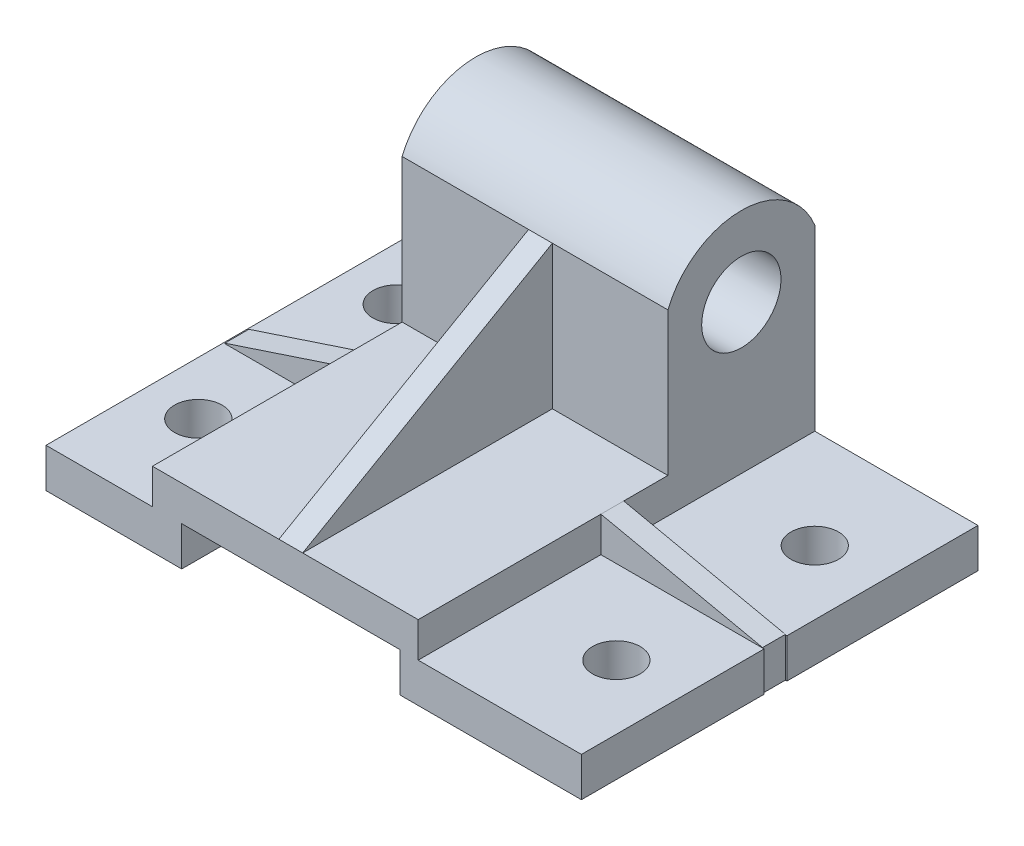
ISO-10303-21;
HEADER;
FILE_DESCRIPTION(('STEP AP214'),'2;1');
FILE_NAME('part.step','',(''),(''),'','','');
FILE_SCHEMA(('AUTOMOTIVE_DESIGN { 1 0 10303 214 1 1 1 1 }'));
ENDSEC;
DATA;
#1=APPLICATION_CONTEXT('core data for automotive mechanical design processes');
#2=APPLICATION_PROTOCOL_DEFINITION('international standard','automotive_design',2000,#1);
#3=PRODUCT_CONTEXT('',#1,'mechanical');
#4=PRODUCT('Part','Part','',(#3));
#5=PRODUCT_RELATED_PRODUCT_CATEGORY('part','',(#4));
#6=PRODUCT_DEFINITION_FORMATION('','',#4);
#7=PRODUCT_DEFINITION_CONTEXT('part definition',#1,'design');
#8=PRODUCT_DEFINITION('design','',#6,#7);
#9=PRODUCT_DEFINITION_SHAPE('','',#8);
#10=(LENGTH_UNIT() NAMED_UNIT(*) SI_UNIT(.MILLI.,.METRE.));
#11=(NAMED_UNIT(*) PLANE_ANGLE_UNIT() SI_UNIT($,.RADIAN.));
#12=(NAMED_UNIT(*) SI_UNIT($,.STERADIAN.) SOLID_ANGLE_UNIT());
#13=UNCERTAINTY_MEASURE_WITH_UNIT(LENGTH_MEASURE(1.E-05),#10,'distance_accuracy_value','');
#14=(GEOMETRIC_REPRESENTATION_CONTEXT(3) GLOBAL_UNCERTAINTY_ASSIGNED_CONTEXT((#13)) GLOBAL_UNIT_ASSIGNED_CONTEXT((#10,
#11,#12)) REPRESENTATION_CONTEXT('',''));
#15=CARTESIAN_POINT('',(0.,0.,0.));
#16=DIRECTION('',(0.,0.,1.));
#17=DIRECTION('',(1.,0.,0.));
#18=AXIS2_PLACEMENT_3D('',#15,#16,#17);
#19=CARTESIAN_POINT('',(73.2762836185819,9.90220048899755,-100.));
#20=DIRECTION('',(1.,0.,0.));
#21=DIRECTION('',(0.,0.,-1.));
#22=AXIS2_PLACEMENT_3D('',#19,#20,#21);
#23=PLANE('',#22);
#24=DIRECTION('',(0.,1.,0.));
#25=VECTOR('',#24,1.);
#26=CARTESIAN_POINT('',(73.2762836185819,9.90220048899751,-51.82695280741));
#27=LINE('',#26,#25);
#28=CARTESIAN_POINT('',(73.2762836185819,0.,-51.82695280741));
#29=VERTEX_POINT('',#28);
#30=CARTESIAN_POINT('',(73.2762836185819,9.90220048899755,-51.82695280741));
#31=VERTEX_POINT('',#30);
#32=EDGE_CURVE('E526',#29,#31,#27,.T.);
#33=ORIENTED_EDGE('',*,*,#32,.F.);
#34=DIRECTION('',(0.,0.,1.));
#35=VECTOR('',#34,1.);
#36=CARTESIAN_POINT('',(73.2762836185819,0.,-100.));
#37=LINE('',#36,#35);
#38=CARTESIAN_POINT('',(73.2762836185819,0.,-100.));
#39=VERTEX_POINT('',#38);
#40=EDGE_CURVE('E438',#39,#29,#37,.T.);
#41=ORIENTED_EDGE('',*,*,#40,.F.);
#42=DIRECTION('',(0.,1.,0.));
#43=VECTOR('',#42,1.);
#44=CARTESIAN_POINT('',(73.2762836185819,9.90220048899755,-100.));
#45=LINE('',#44,#43);
#46=CARTESIAN_POINT('',(73.2762836185819,9.90220048899755,-100.));
#47=VERTEX_POINT('',#46);
#48=EDGE_CURVE('E381',#39,#47,#45,.T.);
#49=ORIENTED_EDGE('',*,*,#48,.T.);
#50=DIRECTION('',(0.,0.,1.));
#51=VECTOR('',#50,1.);
#52=CARTESIAN_POINT('',(73.2762836185819,9.90220048899755,-100.));
#53=LINE('',#52,#51);
#54=EDGE_CURVE('E434',#47,#31,#53,.T.);
#55=ORIENTED_EDGE('',*,*,#54,.T.);
#56=EDGE_LOOP('',(#33,#41,#49,#55));
#57=FACE_BOUND('',#56,.T.);
#58=ADVANCED_FACE('F33',(#57),#23,.T.);
#59=CARTESIAN_POINT('',(31.6683148457741,9.90220048899755,-100.));
#60=DIRECTION('',(0.,1.,0.));
#61=DIRECTION('',(0.,0.,1.));
#62=AXIS2_PLACEMENT_3D('',#59,#60,#61);
#63=PLANE('',#62);
#64=CARTESIAN_POINT('',(57.109031968355,9.90220048899755,-24.9834886291718));
#65=DIRECTION('',(0.,1.,0.));
#66=DIRECTION('',(0.,0.,1.));
#67=AXIS2_PLACEMENT_3D('',#64,#65,#66);
#68=CIRCLE('',#67,6.);
#69=CARTESIAN_POINT('',(57.109031968355,9.90220048899755,-18.9834886291718));
#70=VERTEX_POINT('',#69);
#71=EDGE_CURVE('E304',#70,#70,#68,.T.);
#72=ORIENTED_EDGE('',*,*,#71,.F.);
#73=EDGE_LOOP('',(#72));
#74=FACE_BOUND('',#73,.T.);
#75=CARTESIAN_POINT('',(73.2762836185819,9.90220048899755,-46.0681130754779));
#76=VERTEX_POINT('',#75);
#77=CARTESIAN_POINT('',(73.2762836185819,9.90220048899755,0.));
#78=VERTEX_POINT('',#77);
#79=EDGE_CURVE('E437',#76,#78,#53,.T.);
#80=ORIENTED_EDGE('',*,*,#79,.F.);
#81=DIRECTION('',(-1.,0.,0.));
#82=VECTOR('',#81,1.);
#83=CARTESIAN_POINT('',(74.1194687660905,9.90220048899755,-46.0681130754779));
#84=LINE('',#83,#82);
#85=CARTESIAN_POINT('',(72.8841531670512,9.90220048899754,-46.0681130754779));
#86=VERTEX_POINT('',#85);
#87=EDGE_CURVE('E258',#76,#86,#84,.T.);
#88=ORIENTED_EDGE('',*,*,#87,.T.);
#89=CARTESIAN_POINT('',(32.1194687660905,9.90220048899755,-46.0681130754779));
#90=VERTEX_POINT('',#89);
#91=EDGE_CURVE('E239',#86,#90,#84,.T.);
#92=ORIENTED_EDGE('',*,*,#91,.T.);
#93=DIRECTION('',(0.,0.,1.));
#94=VECTOR('',#93,1.);
#95=CARTESIAN_POINT('',(32.1194687660905,9.90220048899755,0.));
#96=LINE('',#95,#94);
#97=CARTESIAN_POINT('',(32.1194687660905,9.90220048899755,0.));
#98=VERTEX_POINT('',#97);
#99=EDGE_CURVE('E330',#90,#98,#96,.T.);
#100=ORIENTED_EDGE('',*,*,#99,.T.);
#101=DIRECTION('',(-1.,0.,0.));
#102=VECTOR('',#101,1.);
#103=CARTESIAN_POINT('',(31.6683148457741,9.90220048899755,0.));
#104=LINE('',#103,#102);
#105=EDGE_CURVE('E414',#78,#98,#104,.T.);
#106=ORIENTED_EDGE('',*,*,#105,.F.);
#107=EDGE_LOOP('',(#80,#88,#92,#100,#106));
#108=FACE_BOUND('',#107,.T.);
#109=ADVANCED_FACE('F486',(#74,#108),#63,.T.);
#110=CARTESIAN_POINT('',(57.109031968355,9.90220048899755,-75.0046438024947));
#111=DIRECTION('',(0.,1.,0.));
#112=DIRECTION('',(0.,0.,1.));
#113=AXIS2_PLACEMENT_3D('',#110,#111,#112);
#114=CIRCLE('',#113,6.);
#115=CARTESIAN_POINT('',(57.109031968355,9.90220048899755,-69.0046438024947));
#116=VERTEX_POINT('',#115);
#117=EDGE_CURVE('E308',#116,#116,#114,.T.);
#118=ORIENTED_EDGE('',*,*,#117,.F.);
#119=EDGE_LOOP('',(#118));
#120=FACE_BOUND('',#119,.T.);
#121=CARTESIAN_POINT('',(32.1194687660905,9.90220048899755,-100.));
#122=VERTEX_POINT('',#121);
#123=CARTESIAN_POINT('',(32.1194687660905,9.90220048899755,-51.82695280741));
#124=VERTEX_POINT('',#123);
#125=EDGE_CURVE('E326',#122,#124,#96,.T.);
#126=ORIENTED_EDGE('',*,*,#125,.T.);
#127=DIRECTION('',(-1.,0.,0.));
#128=VECTOR('',#127,1.);
#129=CARTESIAN_POINT('',(74.1194687660905,9.90220048899755,-51.82695280741));
#130=LINE('',#129,#128);
#131=CARTESIAN_POINT('',(72.8841531670512,9.90220048899754,-51.82695280741));
#132=VERTEX_POINT('',#131);
#133=EDGE_CURVE('E254',#132,#124,#130,.T.);
#134=ORIENTED_EDGE('',*,*,#133,.F.);
#135=EDGE_CURVE('E256',#31,#132,#130,.T.);
#136=ORIENTED_EDGE('',*,*,#135,.F.);
#137=ORIENTED_EDGE('',*,*,#54,.F.);
#138=DIRECTION('',(-1.,0.,0.));
#139=VECTOR('',#138,1.);
#140=CARTESIAN_POINT('',(31.6683148457741,9.90220048899755,-100.));
#141=LINE('',#140,#139);
#142=EDGE_CURVE('E384',#47,#122,#141,.T.);
#143=ORIENTED_EDGE('',*,*,#142,.T.);
#144=EDGE_LOOP('',(#126,#134,#136,#137,#143));
#145=FACE_BOUND('',#144,.T.);
#146=ADVANCED_FACE('F492',(#120,#145),#63,.T.);
#147=CARTESIAN_POINT('',(32.1194687660905,47.3569143511102,-81.4805950650293));
#148=DIRECTION('',(1.,0.,0.));
#149=DIRECTION('',(0.,0.,-1.));
#150=AXIS2_PLACEMENT_3D('',#147,#148,#149);
#151=PLANE('',#150);
#152=ORIENTED_EDGE('',*,*,#99,.F.);
#153=DIRECTION('',(0.,-1.,0.));
#154=VECTOR('',#153,1.);
#155=CARTESIAN_POINT('',(32.1194687660905,9.90220048899755,-46.0681130754779));
#156=LINE('',#155,#154);
#157=CARTESIAN_POINT('',(32.1194687660905,18.7499877018524,-46.0681130754779));
#158=VERTEX_POINT('',#157);
#159=EDGE_CURVE('E246',#158,#90,#156,.T.);
#160=ORIENTED_EDGE('',*,*,#159,.F.);
#161=DIRECTION('',(0.,0.,-1.));
#162=VECTOR('',#161,1.);
#163=CARTESIAN_POINT('',(32.1194687660905,18.7499877018524,-62.9611901300586));
#164=LINE('',#163,#162);
#165=CARTESIAN_POINT('',(32.1194687660905,18.7499877018524,0.));
#166=VERTEX_POINT('',#165);
#167=EDGE_CURVE('E334',#166,#158,#164,.T.);
#168=ORIENTED_EDGE('',*,*,#167,.F.);
#169=DIRECTION('',(0.,1.,0.));
#170=VECTOR('',#169,1.);
#171=CARTESIAN_POINT('',(32.1194687660905,18.7499877018524,0.));
#172=LINE('',#171,#170);
#173=EDGE_CURVE('E329',#98,#166,#172,.T.);
#174=ORIENTED_EDGE('',*,*,#173,.F.);
#175=EDGE_LOOP('',(#152,#160,#168,#174));
#176=FACE_BOUND('',#175,.T.);
#177=ADVANCED_FACE('F557',(#176),#151,.T.);
#178=CARTESIAN_POINT('',(32.1194687660905,47.3569143511102,-81.4805950650293));
#179=DIRECTION('',(-1.,0.,0.));
#180=DIRECTION('',(0.,0.,1.));
#181=AXIS2_PLACEMENT_3D('',#178,#179,#180);
#182=CIRCLE('',#181,9.99999999999999);
#183=CARTESIAN_POINT('',(32.1194687660905,47.3569143511102,-71.4805950650293));
#184=VERTEX_POINT('',#183);
#185=EDGE_CURVE('E318',#184,#184,#182,.T.);
#186=ORIENTED_EDGE('',*,*,#185,.T.);
#187=EDGE_LOOP('',(#186));
#188=FACE_BOUND('',#187,.T.);
#189=CARTESIAN_POINT('',(32.1194687660905,18.7499877018524,-51.82695280741));
#190=VERTEX_POINT('',#189);
#191=CARTESIAN_POINT('',(32.1194687660905,18.7499877018524,-62.9611901300586));
#192=VERTEX_POINT('',#191);
#193=EDGE_CURVE('E333',#190,#192,#164,.T.);
#194=ORIENTED_EDGE('',*,*,#193,.F.);
#195=DIRECTION('',(0.,1.,0.));
#196=VECTOR('',#195,1.);
#197=CARTESIAN_POINT('',(32.1194687660905,18.7499877018524,-51.82695280741));
#198=LINE('',#197,#196);
#199=EDGE_CURVE('E248',#124,#190,#198,.T.);
#200=ORIENTED_EDGE('',*,*,#199,.F.);
#201=ORIENTED_EDGE('',*,*,#125,.F.);
#202=DIRECTION('',(0.,-1.,0.));
#203=VECTOR('',#202,1.);
#204=CARTESIAN_POINT('',(32.1194687660905,9.90220048899755,-100.));
#205=LINE('',#204,#203);
#206=CARTESIAN_POINT('',(32.1194687660905,54.9088439624469,-100.));
#207=VERTEX_POINT('',#206);
#208=EDGE_CURVE('E342',#207,#122,#205,.T.);
#209=ORIENTED_EDGE('',*,*,#208,.F.);
#210=CARTESIAN_POINT('',(32.1194687660905,47.3569143511102,-81.4805950650293));
#211=DIRECTION('',(-1.,0.,0.));
#212=DIRECTION('',(0.,0.,-1.));
#213=AXIS2_PLACEMENT_3D('',#210,#211,#212);
#214=CIRCLE('',#213,20.);
#215=CARTESIAN_POINT('',(32.1194687660905,54.9088439624469,-62.9611901300586));
#216=VERTEX_POINT('',#215);
#217=EDGE_CURVE('E339',#216,#207,#214,.T.);
#218=ORIENTED_EDGE('',*,*,#217,.F.);
#219=DIRECTION('',(0.,1.,0.));
#220=VECTOR('',#219,1.);
#221=CARTESIAN_POINT('',(32.1194687660905,54.9088439624469,-62.9611901300586));
#222=LINE('',#221,#220);
#223=EDGE_CURVE('E336',#192,#216,#222,.T.);
#224=ORIENTED_EDGE('',*,*,#223,.F.);
#225=EDGE_LOOP('',(#194,#200,#201,#209,#218,#224));
#226=FACE_BOUND('',#225,.T.);
#227=ADVANCED_FACE('F543',(#188,#226),#151,.T.);
#228=CARTESIAN_POINT('',(-61.7237163814181,9.90220048899755,-100.));
#229=DIRECTION('',(0.,1.,0.));
#230=DIRECTION('',(0.,0.,1.));
#231=AXIS2_PLACEMENT_3D('',#228,#229,#230);
#232=PLANE('',#231);
#233=CARTESIAN_POINT('',(-48.3021238076638,9.90220048899755,-24.9834886291718));
#234=DIRECTION('',(0.,1.,0.));
#235=DIRECTION('',(0.,0.,1.));
#236=AXIS2_PLACEMENT_3D('',#233,#234,#235);
#237=CIRCLE('',#236,6.);
#238=CARTESIAN_POINT('',(-48.3021238076638,9.90220048899755,-18.9834886291718));
#239=VERTEX_POINT('',#238);
#240=EDGE_CURVE('E312',#239,#239,#237,.T.);
#241=ORIENTED_EDGE('',*,*,#240,.F.);
#242=EDGE_LOOP('',(#241));
#243=FACE_BOUND('',#242,.T.);
#244=CARTESIAN_POINT('',(-48.3021238076638,9.90220048899755,-75.0046438024947));
#245=DIRECTION('',(0.,1.,0.));
#246=DIRECTION('',(0.,0.,1.));
#247=AXIS2_PLACEMENT_3D('',#244,#245,#246);
#248=CIRCLE('',#247,6.);
#249=CARTESIAN_POINT('',(-48.3021238076638,9.90220048899755,-69.0046438024947));
#250=VERTEX_POINT('',#249);
#251=EDGE_CURVE('E311',#250,#250,#248,.T.);
#252=ORIENTED_EDGE('',*,*,#251,.F.);
#253=EDGE_LOOP('',(#252));
#254=FACE_BOUND('',#253,.T.);
#255=DIRECTION('',(0.,0.,1.));
#256=VECTOR('',#255,1.);
#257=CARTESIAN_POINT('',(-61.3805312339095,9.90220048899755,-44.7398529123788));
#258=LINE('',#257,#256);
#259=CARTESIAN_POINT('',(-61.3805312339095,9.90220048899755,-50.8076177196593));
#260=VERTEX_POINT('',#259);
#261=CARTESIAN_POINT('',(-61.3805312339095,9.90220048899755,-44.7398529123788));
#262=VERTEX_POINT('',#261);
#263=EDGE_CURVE('E268',#260,#262,#258,.T.);
#264=ORIENTED_EDGE('',*,*,#263,.F.);
#265=DIRECTION('',(1.,0.,0.));
#266=VECTOR('',#265,1.);
#267=CARTESIAN_POINT('',(-61.3805312339095,9.90220048899755,-50.8076177196593));
#268=LINE('',#267,#266);
#269=CARTESIAN_POINT('',(-34.8805312339096,9.90220048899755,-50.8076177196593));
#270=VERTEX_POINT('',#269);
#271=EDGE_CURVE('E279',#260,#270,#268,.T.);
#272=ORIENTED_EDGE('',*,*,#271,.T.);
#273=DIRECTION('',(0.,0.,1.));
#274=VECTOR('',#273,1.);
#275=CARTESIAN_POINT('',(-34.8805312339096,9.90220048899755,-100.));
#276=LINE('',#275,#274);
#277=CARTESIAN_POINT('',(-34.8805312339096,9.90220048899755,-100.));
#278=VERTEX_POINT('',#277);
#279=EDGE_CURVE('E426',#278,#270,#276,.T.);
#280=ORIENTED_EDGE('',*,*,#279,.F.);
#281=DIRECTION('',(-1.,0.,0.));
#282=VECTOR('',#281,1.);
#283=CARTESIAN_POINT('',(-61.7237163814181,9.90220048899755,-100.));
#284=LINE('',#283,#282);
#285=CARTESIAN_POINT('',(-61.7237163814181,9.90220048899755,-100.));
#286=VERTEX_POINT('',#285);
#287=EDGE_CURVE('E390',#278,#286,#284,.T.);
#288=ORIENTED_EDGE('',*,*,#287,.T.);
#289=DIRECTION('',(0.,0.,1.));
#290=VECTOR('',#289,1.);
#291=CARTESIAN_POINT('',(-61.7237163814181,9.90220048899755,-100.));
#292=LINE('',#291,#290);
#293=CARTESIAN_POINT('',(-61.7237163814181,9.90220048899755,0.));
#294=VERTEX_POINT('',#293);
#295=EDGE_CURVE('E41',#286,#294,#292,.T.);
#296=ORIENTED_EDGE('',*,*,#295,.T.);
#297=DIRECTION('',(-1.,0.,0.));
#298=VECTOR('',#297,1.);
#299=CARTESIAN_POINT('',(-61.7237163814181,9.90220048899755,0.));
#300=LINE('',#299,#298);
#301=CARTESIAN_POINT('',(-34.8805312339096,9.90220048899755,0.));
#302=VERTEX_POINT('',#301);
#303=EDGE_CURVE('E366',#302,#294,#300,.T.);
#304=ORIENTED_EDGE('',*,*,#303,.F.);
#305=CARTESIAN_POINT('',(-34.8805312339096,9.90220048899755,-44.7398529123788));
#306=VERTEX_POINT('',#305);
#307=EDGE_CURVE('E429',#306,#302,#276,.T.);
#308=ORIENTED_EDGE('',*,*,#307,.F.);
#309=DIRECTION('',(1.,0.,0.));
#310=VECTOR('',#309,1.);
#311=CARTESIAN_POINT('',(-61.3805312339095,9.90220048899755,-44.7398529123788));
#312=LINE('',#311,#310);
#313=EDGE_CURVE('E274',#262,#306,#312,.T.);
#314=ORIENTED_EDGE('',*,*,#313,.F.);
#315=EDGE_LOOP('',(#264,#272,#280,#288,#296,#304,#308,#314));
#316=FACE_BOUND('',#315,.T.);
#317=ADVANCED_FACE('F564',(#243,#254,#316),#232,.T.);
#318=CARTESIAN_POINT('',(-34.8805312339096,9.90220048899755,-100.));
#319=DIRECTION('',(-1.,0.,0.));
#320=DIRECTION('',(0.,0.,1.));
#321=AXIS2_PLACEMENT_3D('',#318,#319,#320);
#322=PLANE('',#321);
#323=DIRECTION('',(0.,0.,1.));
#324=VECTOR('',#323,1.);
#325=CARTESIAN_POINT('',(-34.8805312339096,18.7499877018524,-100.));
#326=LINE('',#325,#324);
#327=CARTESIAN_POINT('',(-34.8805312339096,18.7499877018524,-62.9611901300586));
#328=VERTEX_POINT('',#327);
#329=CARTESIAN_POINT('',(-34.8805312339096,18.7499877018524,-50.8076177196592));
#330=VERTEX_POINT('',#329);
#331=EDGE_CURVE('E430',#328,#330,#326,.T.);
#332=ORIENTED_EDGE('',*,*,#331,.F.);
#333=DIRECTION('',(0.,1.,0.));
#334=VECTOR('',#333,1.);
#335=CARTESIAN_POINT('',(-34.8805312339096,54.9088439624469,-62.9611901300586));
#336=LINE('',#335,#334);
#337=CARTESIAN_POINT('',(-34.8805312339096,54.9088439624469,-62.9611901300586));
#338=VERTEX_POINT('',#337);
#339=EDGE_CURVE('E321',#328,#338,#336,.T.);
#340=ORIENTED_EDGE('',*,*,#339,.T.);
#341=CARTESIAN_POINT('',(-34.8805312339096,47.3569143511102,-81.4805950650293));
#342=DIRECTION('',(-1.,0.,0.));
#343=DIRECTION('',(0.,0.,-1.));
#344=AXIS2_PLACEMENT_3D('',#341,#342,#343);
#345=CIRCLE('',#344,20.);
#346=CARTESIAN_POINT('',(-34.8805312339096,54.9088439624469,-100.));
#347=VERTEX_POINT('',#346);
#348=EDGE_CURVE('E348',#338,#347,#345,.T.);
#349=ORIENTED_EDGE('',*,*,#348,.T.);
#350=DIRECTION('',(0.,-1.,0.));
#351=VECTOR('',#350,1.);
#352=CARTESIAN_POINT('',(-34.8805312339096,9.90220048899755,-100.));
#353=LINE('',#352,#351);
#354=EDGE_CURVE('E387',#347,#278,#353,.T.);
#355=ORIENTED_EDGE('',*,*,#354,.T.);
#356=ORIENTED_EDGE('',*,*,#279,.T.);
#357=DIRECTION('',(0.,-1.,0.));
#358=VECTOR('',#357,1.);
#359=CARTESIAN_POINT('',(-34.8805312339096,18.7499877018524,-50.8076177196592));
#360=LINE('',#359,#358);
#361=EDGE_CURVE('E265',#330,#270,#360,.T.);
#362=ORIENTED_EDGE('',*,*,#361,.F.);
#363=EDGE_LOOP('',(#332,#340,#349,#355,#356,#362));
#364=FACE_BOUND('',#363,.T.);
#365=CARTESIAN_POINT('',(-34.8805312339096,47.3569143511102,-81.4805950650293));
#366=DIRECTION('',(-1.,0.,0.));
#367=DIRECTION('',(0.,0.,1.));
#368=AXIS2_PLACEMENT_3D('',#365,#366,#367);
#369=CIRCLE('',#368,9.99999999999999);
#370=CARTESIAN_POINT('',(-34.8805312339096,47.3569143511102,-71.4805950650293));
#371=VERTEX_POINT('',#370);
#372=EDGE_CURVE('E322',#371,#371,#369,.T.);
#373=ORIENTED_EDGE('',*,*,#372,.F.);
#374=EDGE_LOOP('',(#373));
#375=FACE_BOUND('',#374,.T.);
#376=ADVANCED_FACE('F588',(#364,#375),#322,.T.);
#377=CARTESIAN_POINT('',(-34.8805312339096,18.7499877018524,-44.7398529123788));
#378=VERTEX_POINT('',#377);
#379=CARTESIAN_POINT('',(-34.8805312339096,18.7499877018524,0.));
#380=VERTEX_POINT('',#379);
#381=EDGE_CURVE('E433',#378,#380,#326,.T.);
#382=ORIENTED_EDGE('',*,*,#381,.F.);
#383=DIRECTION('',(0.,1.,0.));
#384=VECTOR('',#383,1.);
#385=CARTESIAN_POINT('',(-34.8805312339096,18.7499877018524,-44.7398529123788));
#386=LINE('',#385,#384);
#387=EDGE_CURVE('E269',#306,#378,#386,.T.);
#388=ORIENTED_EDGE('',*,*,#387,.F.);
#389=ORIENTED_EDGE('',*,*,#307,.T.);
#390=DIRECTION('',(0.,-1.,0.));
#391=VECTOR('',#390,1.);
#392=CARTESIAN_POINT('',(-34.8805312339096,9.90220048899755,0.));
#393=LINE('',#392,#391);
#394=EDGE_CURVE('E420',#380,#302,#393,.T.);
#395=ORIENTED_EDGE('',*,*,#394,.F.);
#396=EDGE_LOOP('',(#382,#388,#389,#395));
#397=FACE_BOUND('',#396,.T.);
#398=ADVANCED_FACE('F591',(#397),#322,.T.);
#399=CARTESIAN_POINT('',(-34.8805312339096,18.7499877018524,-100.));
#400=DIRECTION('',(0.,1.,0.));
#401=DIRECTION('',(0.,0.,1.));
#402=AXIS2_PLACEMENT_3D('',#399,#400,#401);
#403=PLANE('',#402);
#404=DIRECTION('',(0.,0.,-1.));
#405=VECTOR('',#404,1.);
#406=CARTESIAN_POINT('',(32.1194687660905,18.7499877018524,-9.82695280741001));
#407=LINE('',#406,#405);
#408=EDGE_CURVE('E229',#158,#190,#407,.T.);
#409=ORIENTED_EDGE('',*,*,#408,.T.);
#410=ORIENTED_EDGE('',*,*,#193,.T.);
#411=DIRECTION('',(-1.,0.,0.));
#412=VECTOR('',#411,1.);
#413=CARTESIAN_POINT('',(32.1194687660905,18.7499877018524,-62.9611901300586));
#414=LINE('',#413,#412);
#415=CARTESIAN_POINT('',(3.,18.7499877018524,-62.9611901300586));
#416=VERTEX_POINT('',#415);
#417=EDGE_CURVE('E359',#192,#416,#414,.T.);
#418=ORIENTED_EDGE('',*,*,#417,.T.);
#419=DIRECTION('',(0.,0.,-1.));
#420=VECTOR('',#419,1.);
#421=CARTESIAN_POINT('',(3.,18.7499877018524,0.));
#422=LINE('',#421,#420);
#423=CARTESIAN_POINT('',(3.,18.7499877018524,0.));
#424=VERTEX_POINT('',#423);
#425=EDGE_CURVE('E290',#424,#416,#422,.T.);
#426=ORIENTED_EDGE('',*,*,#425,.F.);
#427=DIRECTION('',(-1.,0.,0.));
#428=VECTOR('',#427,1.);
#429=CARTESIAN_POINT('',(-34.8805312339096,18.7499877018524,0.));
#430=LINE('',#429,#428);
#431=EDGE_CURVE('E417',#166,#424,#430,.T.);
#432=ORIENTED_EDGE('',*,*,#431,.F.);
#433=ORIENTED_EDGE('',*,*,#167,.T.);
#434=EDGE_LOOP('',(#409,#410,#418,#426,#432,#433));
#435=FACE_BOUND('',#434,.T.);
#436=ADVANCED_FACE('F503',(#435),#403,.T.);
#437=CARTESIAN_POINT('',(32.1194687660905,54.9088439624469,-62.9611901300586));
#438=DIRECTION('',(0.,0.,1.));
#439=DIRECTION('',(1.,0.,0.));
#440=AXIS2_PLACEMENT_3D('',#437,#438,#439);
#441=PLANE('',#440);
#442=DIRECTION('',(-1.,0.,0.));
#443=VECTOR('',#442,1.);
#444=CARTESIAN_POINT('',(32.1194687660905,54.9088439624469,-62.9611901300586));
#445=LINE('',#444,#443);
#446=CARTESIAN_POINT('',(3.,54.9088439624469,-62.9611901300586));
#447=VERTEX_POINT('',#446);
#448=EDGE_CURVE('E355',#216,#447,#445,.T.);
#449=ORIENTED_EDGE('',*,*,#448,.T.);
#450=DIRECTION('',(0.,1.,0.));
#451=VECTOR('',#450,1.);
#452=CARTESIAN_POINT('',(3.,18.7499877018524,-62.9611901300586));
#453=LINE('',#452,#451);
#454=EDGE_CURVE('E283',#416,#447,#453,.T.);
#455=ORIENTED_EDGE('',*,*,#454,.F.);
#456=ORIENTED_EDGE('',*,*,#417,.F.);
#457=ORIENTED_EDGE('',*,*,#223,.T.);
#458=EDGE_LOOP('',(#449,#455,#456,#457));
#459=FACE_BOUND('',#458,.T.);
#460=ADVANCED_FACE('F547',(#459),#441,.T.);
#461=CARTESIAN_POINT('',(-61.7237163814181,0.,-100.));
#462=DIRECTION('',(-1.,0.,0.));
#463=DIRECTION('',(0.,0.,1.));
#464=AXIS2_PLACEMENT_3D('',#461,#462,#463);
#465=PLANE('',#464);
#466=DIRECTION('',(0.,-1.,0.));
#467=VECTOR('',#466,1.);
#468=CARTESIAN_POINT('',(-61.7237163814181,0.,0.));
#469=LINE('',#468,#467);
#470=CARTESIAN_POINT('',(-61.7237163814181,0.,0.));
#471=VERTEX_POINT('',#470);
#472=EDGE_CURVE('E354',#294,#471,#469,.T.);
#473=ORIENTED_EDGE('',*,*,#472,.F.);
#474=ORIENTED_EDGE('',*,*,#295,.F.);
#475=DIRECTION('',(0.,-1.,0.));
#476=VECTOR('',#475,1.);
#477=CARTESIAN_POINT('',(-61.7237163814181,0.,-100.));
#478=LINE('',#477,#476);
#479=CARTESIAN_POINT('',(-61.7237163814181,0.,-100.));
#480=VERTEX_POINT('',#479);
#481=EDGE_CURVE('E362',#286,#480,#478,.T.);
#482=ORIENTED_EDGE('',*,*,#481,.T.);
#483=DIRECTION('',(0.,0.,1.));
#484=VECTOR('',#483,1.);
#485=CARTESIAN_POINT('',(-61.7237163814181,0.,-100.));
#486=LINE('',#485,#484);
#487=EDGE_CURVE('E393',#480,#471,#486,.T.);
#488=ORIENTED_EDGE('',*,*,#487,.T.);
#489=EDGE_LOOP('',(#473,#474,#482,#488));
#490=FACE_BOUND('',#489,.T.);
#491=ADVANCED_FACE('F35',(#490),#465,.T.);
#492=DIRECTION('',(0.,0.,1.));
#493=VECTOR('',#492,1.);
#494=CARTESIAN_POINT('',(-34.8805312339096,18.7499877018524,-71.2398529123788));
#495=LINE('',#494,#493);
#496=EDGE_CURVE('E261',#330,#378,#495,.T.);
#497=ORIENTED_EDGE('',*,*,#496,.T.);
#498=ORIENTED_EDGE('',*,*,#381,.T.);
#499=CARTESIAN_POINT('',(-3.,18.7499877018524,0.));
#500=VERTEX_POINT('',#499);
#501=EDGE_CURVE('E55',#500,#380,#430,.T.);
#502=ORIENTED_EDGE('',*,*,#501,.F.);
#503=DIRECTION('',(0.,0.,-1.));
#504=VECTOR('',#503,1.);
#505=CARTESIAN_POINT('',(-3.,18.7499877018524,0.));
#506=LINE('',#505,#504);
#507=CARTESIAN_POINT('',(-3.,18.7499877018524,-62.9611901300586));
#508=VERTEX_POINT('',#507);
#509=EDGE_CURVE('E287',#500,#508,#506,.T.);
#510=ORIENTED_EDGE('',*,*,#509,.T.);
#511=EDGE_CURVE('E345',#508,#328,#414,.T.);
#512=ORIENTED_EDGE('',*,*,#511,.T.);
#513=ORIENTED_EDGE('',*,*,#331,.T.);
#514=EDGE_LOOP('',(#497,#498,#502,#510,#512,#513));
#515=FACE_BOUND('',#514,.T.);
#516=ADVANCED_FACE('F497',(#515),#403,.T.);
#517=DIRECTION('',(0.,-1.,0.));
#518=VECTOR('',#517,1.);
#519=CARTESIAN_POINT('',(73.2762836185819,9.90220048899751,-46.0681130754779));
#520=LINE('',#519,#518);
#521=CARTESIAN_POINT('',(73.2762836185819,0.,-46.0681130754779));
#522=VERTEX_POINT('',#521);
#523=EDGE_CURVE('E506',#76,#522,#520,.T.);
#524=ORIENTED_EDGE('',*,*,#523,.F.);
#525=ORIENTED_EDGE('',*,*,#79,.T.);
#526=DIRECTION('',(0.,1.,0.));
#527=VECTOR('',#526,1.);
#528=CARTESIAN_POINT('',(73.2762836185819,9.90220048899755,0.));
#529=LINE('',#528,#527);
#530=CARTESIAN_POINT('',(73.2762836185819,0.,0.));
#531=VERTEX_POINT('',#530);
#532=EDGE_CURVE('E411',#531,#78,#529,.T.);
#533=ORIENTED_EDGE('',*,*,#532,.F.);
#534=EDGE_CURVE('E441',#522,#531,#37,.T.);
#535=ORIENTED_EDGE('',*,*,#534,.F.);
#536=EDGE_LOOP('',(#524,#525,#533,#535));
#537=FACE_BOUND('',#536,.T.);
#538=ADVANCED_FACE('F465',(#537),#23,.T.);
#539=CARTESIAN_POINT('',(27.5,0.,-100.));
#540=DIRECTION('',(0.,-1.,0.));
#541=DIRECTION('',(1.,0.,0.));
#542=AXIS2_PLACEMENT_3D('',#539,#540,#541);
#543=PLANE('',#542);
#544=DIRECTION('',(1.,0.,0.));
#545=VECTOR('',#544,1.);
#546=CARTESIAN_POINT('',(27.5,0.,-51.82695280741));
#547=LINE('',#546,#545);
#548=CARTESIAN_POINT('',(72.8841531670512,0.,-51.82695280741));
#549=VERTEX_POINT('',#548);
#550=EDGE_CURVE('E528',#549,#29,#547,.T.);
#551=ORIENTED_EDGE('',*,*,#550,.F.);
#552=DIRECTION('',(0.,0.,-1.));
#553=VECTOR('',#552,1.);
#554=CARTESIAN_POINT('',(72.8841531670512,0.,-100.));
#555=LINE('',#554,#553);
#556=CARTESIAN_POINT('',(72.8841531670512,0.,-46.0681130754779));
#557=VERTEX_POINT('',#556);
#558=EDGE_CURVE('E525',#557,#549,#555,.T.);
#559=ORIENTED_EDGE('',*,*,#558,.F.);
#560=DIRECTION('',(-1.,0.,0.));
#561=VECTOR('',#560,1.);
#562=CARTESIAN_POINT('',(27.5000000000006,0.,-46.0681130754774));
#563=LINE('',#562,#561);
#564=EDGE_CURVE('E512',#522,#557,#563,.T.);
#565=ORIENTED_EDGE('',*,*,#564,.F.);
#566=ORIENTED_EDGE('',*,*,#534,.T.);
#567=DIRECTION('',(1.,0.,0.));
#568=VECTOR('',#567,1.);
#569=CARTESIAN_POINT('',(27.5,0.,0.));
#570=LINE('',#569,#568);
#571=CARTESIAN_POINT('',(27.5,0.,0.));
#572=VERTEX_POINT('',#571);
#573=EDGE_CURVE('E408',#572,#531,#570,.T.);
#574=ORIENTED_EDGE('',*,*,#573,.F.);
#575=DIRECTION('',(0.,0.,1.));
#576=VECTOR('',#575,1.);
#577=CARTESIAN_POINT('',(27.5,0.,-100.));
#578=LINE('',#577,#576);
#579=CARTESIAN_POINT('',(27.5,0.,-100.));
#580=VERTEX_POINT('',#579);
#581=EDGE_CURVE('E442',#580,#572,#578,.T.);
#582=ORIENTED_EDGE('',*,*,#581,.F.);
#583=DIRECTION('',(1.,0.,0.));
#584=VECTOR('',#583,1.);
#585=CARTESIAN_POINT('',(27.5,0.,-100.));
#586=LINE('',#585,#584);
#587=EDGE_CURVE('E378',#580,#39,#586,.T.);
#588=ORIENTED_EDGE('',*,*,#587,.T.);
#589=ORIENTED_EDGE('',*,*,#40,.T.);
#590=EDGE_LOOP('',(#551,#559,#565,#566,#574,#582,#588,#589));
#591=FACE_BOUND('',#590,.T.);
#592=CARTESIAN_POINT('',(57.109031968355,0.,-75.0046438024947));
#593=DIRECTION('',(0.,-1.,0.));
#594=DIRECTION('',(1.,0.,0.));
#595=AXIS2_PLACEMENT_3D('',#592,#593,#594);
#596=CIRCLE('',#595,6.);
#597=CARTESIAN_POINT('',(63.109031968355,0.,-75.0046438024947));
#598=VERTEX_POINT('',#597);
#599=EDGE_CURVE('E307',#598,#598,#596,.T.);
#600=ORIENTED_EDGE('',*,*,#599,.F.);
#601=EDGE_LOOP('',(#600));
#602=FACE_BOUND('',#601,.T.);
#603=CARTESIAN_POINT('',(57.109031968355,0.,-24.9834886291718));
#604=DIRECTION('',(0.,-1.,0.));
#605=DIRECTION('',(1.,0.,0.));
#606=AXIS2_PLACEMENT_3D('',#603,#604,#605);
#607=CIRCLE('',#606,6.);
#608=CARTESIAN_POINT('',(63.109031968355,0.,-24.9834886291718));
#609=VERTEX_POINT('',#608);
#610=EDGE_CURVE('E303',#609,#609,#607,.T.);
#611=ORIENTED_EDGE('',*,*,#610,.F.);
#612=EDGE_LOOP('',(#611));
#613=FACE_BOUND('',#612,.T.);
#614=ADVANCED_FACE('F461',(#591,#602,#613),#543,.T.);
#615=CARTESIAN_POINT('',(27.5,9.90220048899755,-100.));
#616=DIRECTION('',(-1.,0.,0.));
#617=DIRECTION('',(0.,0.,1.));
#618=AXIS2_PLACEMENT_3D('',#615,#616,#617);
#619=PLANE('',#618);
#620=DIRECTION('',(0.,-1.,0.));
#621=VECTOR('',#620,1.);
#622=CARTESIAN_POINT('',(27.5,9.90220048899755,0.));
#623=LINE('',#622,#621);
#624=CARTESIAN_POINT('',(27.5,9.90220048899755,0.));
#625=VERTEX_POINT('',#624);
#626=EDGE_CURVE('E405',#625,#572,#623,.T.);
#627=ORIENTED_EDGE('',*,*,#626,.F.);
#628=DIRECTION('',(0.,0.,1.));
#629=VECTOR('',#628,1.);
#630=CARTESIAN_POINT('',(27.5,9.90220048899755,-100.));
#631=LINE('',#630,#629);
#632=CARTESIAN_POINT('',(27.5,9.90220048899755,-100.));
#633=VERTEX_POINT('',#632);
#634=EDGE_CURVE('E444',#633,#625,#631,.T.);
#635=ORIENTED_EDGE('',*,*,#634,.F.);
#636=DIRECTION('',(0.,-1.,0.));
#637=VECTOR('',#636,1.);
#638=CARTESIAN_POINT('',(27.5,9.90220048899755,-100.));
#639=LINE('',#638,#637);
#640=EDGE_CURVE('E375',#633,#580,#639,.T.);
#641=ORIENTED_EDGE('',*,*,#640,.T.);
#642=ORIENTED_EDGE('',*,*,#581,.T.);
#643=EDGE_LOOP('',(#627,#635,#641,#642));
#644=FACE_BOUND('',#643,.T.);
#645=ADVANCED_FACE('F464',(#644),#619,.T.);
#646=CARTESIAN_POINT('',(-27.5,9.90220048899755,-100.));
#647=DIRECTION('',(0.,-1.,0.));
#648=DIRECTION('',(0.,0.,-1.));
#649=AXIS2_PLACEMENT_3D('',#646,#647,#648);
#650=PLANE('',#649);
#651=DIRECTION('',(1.,0.,0.));
#652=VECTOR('',#651,1.);
#653=CARTESIAN_POINT('',(-27.5,9.90220048899755,0.));
#654=LINE('',#653,#652);
#655=CARTESIAN_POINT('',(-27.5,9.90220048899755,0.));
#656=VERTEX_POINT('',#655);
#657=EDGE_CURVE('E402',#656,#625,#654,.T.);
#658=ORIENTED_EDGE('',*,*,#657,.F.);
#659=DIRECTION('',(0.,0.,1.));
#660=VECTOR('',#659,1.);
#661=CARTESIAN_POINT('',(-27.5,9.90220048899755,-100.));
#662=LINE('',#661,#660);
#663=CARTESIAN_POINT('',(-27.5,9.90220048899755,-100.));
#664=VERTEX_POINT('',#663);
#665=EDGE_CURVE('E446',#664,#656,#662,.T.);
#666=ORIENTED_EDGE('',*,*,#665,.F.);
#667=DIRECTION('',(1.,0.,0.));
#668=VECTOR('',#667,1.);
#669=CARTESIAN_POINT('',(-27.5,9.90220048899755,-100.));
#670=LINE('',#669,#668);
#671=EDGE_CURVE('E372',#664,#633,#670,.T.);
#672=ORIENTED_EDGE('',*,*,#671,.T.);
#673=ORIENTED_EDGE('',*,*,#634,.T.);
#674=EDGE_LOOP('',(#658,#666,#672,#673));
#675=FACE_BOUND('',#674,.T.);
#676=ADVANCED_FACE('F834',(#675),#650,.T.);
#677=CARTESIAN_POINT('',(-27.5,0.,-100.));
#678=DIRECTION('',(1.,0.,0.));
#679=DIRECTION('',(0.,0.,-1.));
#680=AXIS2_PLACEMENT_3D('',#677,#678,#679);
#681=PLANE('',#680);
#682=DIRECTION('',(0.,1.,0.));
#683=VECTOR('',#682,1.);
#684=CARTESIAN_POINT('',(-27.5,0.,0.));
#685=LINE('',#684,#683);
#686=CARTESIAN_POINT('',(-27.5,0.,0.));
#687=VERTEX_POINT('',#686);
#688=EDGE_CURVE('E399',#687,#656,#685,.T.);
#689=ORIENTED_EDGE('',*,*,#688,.F.);
#690=DIRECTION('',(0.,0.,1.));
#691=VECTOR('',#690,1.);
#692=CARTESIAN_POINT('',(-27.5,0.,-100.));
#693=LINE('',#692,#691);
#694=CARTESIAN_POINT('',(-27.5,0.,-100.));
#695=VERTEX_POINT('',#694);
#696=EDGE_CURVE('E448',#695,#687,#693,.T.);
#697=ORIENTED_EDGE('',*,*,#696,.F.);
#698=DIRECTION('',(0.,1.,0.));
#699=VECTOR('',#698,1.);
#700=CARTESIAN_POINT('',(-27.5,0.,-100.));
#701=LINE('',#700,#699);
#702=EDGE_CURVE('E369',#695,#664,#701,.T.);
#703=ORIENTED_EDGE('',*,*,#702,.T.);
#704=ORIENTED_EDGE('',*,*,#665,.T.);
#705=EDGE_LOOP('',(#689,#697,#703,#704));
#706=FACE_BOUND('',#705,.T.);
#707=ADVANCED_FACE('F838',(#706),#681,.T.);
#708=CARTESIAN_POINT('',(-61.7237163814181,0.,-100.));
#709=DIRECTION('',(0.,-1.,0.));
#710=DIRECTION('',(0.,0.,-1.));
#711=AXIS2_PLACEMENT_3D('',#708,#709,#710);
#712=PLANE('',#711);
#713=CARTESIAN_POINT('',(-48.3021238076638,0.,-24.9834886291718));
#714=DIRECTION('',(0.,-1.,0.));
#715=DIRECTION('',(0.,0.,-1.));
#716=AXIS2_PLACEMENT_3D('',#713,#714,#715);
#717=CIRCLE('',#716,6.);
#718=CARTESIAN_POINT('',(-48.3021238076638,0.,-30.9834886291718));
#719=VERTEX_POINT('',#718);
#720=EDGE_CURVE('E325',#719,#719,#717,.T.);
#721=ORIENTED_EDGE('',*,*,#720,.F.);
#722=EDGE_LOOP('',(#721));
#723=FACE_BOUND('',#722,.T.);
#724=CARTESIAN_POINT('',(-48.3021238076638,0.,-75.0046438024947));
#725=DIRECTION('',(0.,-1.,0.));
#726=DIRECTION('',(0.,0.,-1.));
#727=AXIS2_PLACEMENT_3D('',#724,#725,#726);
#728=CIRCLE('',#727,6.);
#729=CARTESIAN_POINT('',(-48.3021238076638,0.,-81.0046438024947));
#730=VERTEX_POINT('',#729);
#731=EDGE_CURVE('E315',#730,#730,#728,.T.);
#732=ORIENTED_EDGE('',*,*,#731,.F.);
#733=EDGE_LOOP('',(#732));
#734=FACE_BOUND('',#733,.T.);
#735=DIRECTION('',(1.,0.,0.));
#736=VECTOR('',#735,1.);
#737=CARTESIAN_POINT('',(-61.7237163814181,0.,0.));
#738=LINE('',#737,#736);
#739=EDGE_CURVE('E396',#471,#687,#738,.T.);
#740=ORIENTED_EDGE('',*,*,#739,.F.);
#741=ORIENTED_EDGE('',*,*,#487,.F.);
#742=DIRECTION('',(1.,0.,0.));
#743=VECTOR('',#742,1.);
#744=CARTESIAN_POINT('',(-61.7237163814181,0.,-100.));
#745=LINE('',#744,#743);
#746=EDGE_CURVE('E365',#480,#695,#745,.T.);
#747=ORIENTED_EDGE('',*,*,#746,.T.);
#748=ORIENTED_EDGE('',*,*,#696,.T.);
#749=EDGE_LOOP('',(#740,#741,#747,#748));
#750=FACE_BOUND('',#749,.T.);
#751=ADVANCED_FACE('F582',(#723,#734,#750),#712,.T.);
#752=CARTESIAN_POINT('',(0.,0.,-100.));
#753=DIRECTION('',(0.,0.,-1.));
#754=DIRECTION('',(-1.,0.,0.));
#755=AXIS2_PLACEMENT_3D('',#752,#753,#754);
#756=PLANE('',#755);
#757=ORIENTED_EDGE('',*,*,#354,.F.);
#758=DIRECTION('',(-1.,0.,0.));
#759=VECTOR('',#758,1.);
#760=CARTESIAN_POINT('',(32.1194687660905,54.9088439624469,-100.));
#761=LINE('',#760,#759);
#762=EDGE_CURVE('E351',#207,#347,#761,.T.);
#763=ORIENTED_EDGE('',*,*,#762,.F.);
#764=ORIENTED_EDGE('',*,*,#208,.T.);
#765=ORIENTED_EDGE('',*,*,#142,.F.);
#766=ORIENTED_EDGE('',*,*,#48,.F.);
#767=ORIENTED_EDGE('',*,*,#587,.F.);
#768=ORIENTED_EDGE('',*,*,#640,.F.);
#769=ORIENTED_EDGE('',*,*,#671,.F.);
#770=ORIENTED_EDGE('',*,*,#702,.F.);
#771=ORIENTED_EDGE('',*,*,#746,.F.);
#772=ORIENTED_EDGE('',*,*,#481,.F.);
#773=ORIENTED_EDGE('',*,*,#287,.F.);
#774=EDGE_LOOP('',(#757,#763,#764,#765,#766,#767,#768,#769,#770,#771,#772,#773));
#775=FACE_BOUND('',#774,.T.);
#776=ADVANCED_FACE('F579',(#775),#756,.T.);
#777=CARTESIAN_POINT('',(0.,0.,0.));
#778=DIRECTION('',(0.,0.,-1.));
#779=DIRECTION('',(-1.,0.,0.));
#780=AXIS2_PLACEMENT_3D('',#777,#778,#779);
#781=PLANE('',#780);
#782=ORIENTED_EDGE('',*,*,#173,.T.);
#783=ORIENTED_EDGE('',*,*,#431,.T.);
#784=DIRECTION('',(-1.,0.,0.));
#785=VECTOR('',#784,1.);
#786=CARTESIAN_POINT('',(3.,18.7499877018524,0.));
#787=LINE('',#786,#785);
#788=EDGE_CURVE('E293',#424,#500,#787,.T.);
#789=ORIENTED_EDGE('',*,*,#788,.T.);
#790=ORIENTED_EDGE('',*,*,#501,.T.);
#791=ORIENTED_EDGE('',*,*,#394,.T.);
#792=ORIENTED_EDGE('',*,*,#303,.T.);
#793=ORIENTED_EDGE('',*,*,#472,.T.);
#794=ORIENTED_EDGE('',*,*,#739,.T.);
#795=ORIENTED_EDGE('',*,*,#688,.T.);
#796=ORIENTED_EDGE('',*,*,#657,.T.);
#797=ORIENTED_EDGE('',*,*,#626,.T.);
#798=ORIENTED_EDGE('',*,*,#573,.T.);
#799=ORIENTED_EDGE('',*,*,#532,.T.);
#800=ORIENTED_EDGE('',*,*,#105,.T.);
#801=EDGE_LOOP('',(#782,#783,#789,#790,#791,#792,#793,#794,#795,#796,#797,#798,#799,#800));
#802=FACE_BOUND('',#801,.T.);
#803=ADVANCED_FACE('F519',(#802),#781,.F.);
#804=CARTESIAN_POINT('',(32.1194687660905,47.3569143511102,-81.4805950650293));
#805=DIRECTION('',(-1.,0.,0.));
#806=DIRECTION('',(0.,0.,1.));
#807=AXIS2_PLACEMENT_3D('',#804,#805,#806);
#808=CYLINDRICAL_SURFACE('',#807,20.);
#809=ORIENTED_EDGE('',*,*,#348,.F.);
#810=CARTESIAN_POINT('',(-3.,54.9088439624469,-62.9611901300586));
#811=VERTEX_POINT('',#810);
#812=EDGE_CURVE('E358',#811,#338,#445,.T.);
#813=ORIENTED_EDGE('',*,*,#812,.F.);
#814=DIRECTION('',(-1.,0.,0.));
#815=VECTOR('',#814,1.);
#816=CARTESIAN_POINT('',(3.,54.9088439624469,-62.9611901300586));
#817=LINE('',#816,#815);
#818=EDGE_CURVE('E300',#447,#811,#817,.T.);
#819=ORIENTED_EDGE('',*,*,#818,.F.);
#820=ORIENTED_EDGE('',*,*,#448,.F.);
#821=ORIENTED_EDGE('',*,*,#217,.T.);
#822=ORIENTED_EDGE('',*,*,#762,.T.);
#823=EDGE_LOOP('',(#809,#813,#819,#820,#821,#822));
#824=FACE_BOUND('',#823,.T.);
#825=ADVANCED_FACE('F571',(#824),#808,.T.);
#826=DIRECTION('',(0.,1.,0.));
#827=VECTOR('',#826,1.);
#828=CARTESIAN_POINT('',(-3.,18.7499877018524,-62.9611901300586));
#829=LINE('',#828,#827);
#830=EDGE_CURVE('E282',#508,#811,#829,.T.);
#831=ORIENTED_EDGE('',*,*,#830,.T.);
#832=ORIENTED_EDGE('',*,*,#812,.T.);
#833=ORIENTED_EDGE('',*,*,#339,.F.);
#834=ORIENTED_EDGE('',*,*,#511,.F.);
#835=EDGE_LOOP('',(#831,#832,#833,#834));
#836=FACE_BOUND('',#835,.T.);
#837=ADVANCED_FACE('F574',(#836),#441,.T.);
#838=CARTESIAN_POINT('',(32.1194687660905,47.3569143511102,-81.4805950650293));
#839=DIRECTION('',(-1.,0.,0.));
#840=DIRECTION('',(0.,0.,1.));
#841=AXIS2_PLACEMENT_3D('',#838,#839,#840);
#842=CYLINDRICAL_SURFACE('',#841,9.99999999999999);
#843=ORIENTED_EDGE('',*,*,#185,.F.);
#844=EDGE_LOOP('',(#843));
#845=FACE_BOUND('',#844,.T.);
#846=ORIENTED_EDGE('',*,*,#372,.T.);
#847=EDGE_LOOP('',(#846));
#848=FACE_BOUND('',#847,.T.);
#849=ADVANCED_FACE('F569',(#845,#848),#842,.F.);
#850=CARTESIAN_POINT('',(-48.3021238076638,-57.0977995110025,-75.0046438024947));
#851=DIRECTION('',(0.,1.,0.));
#852=DIRECTION('',(0.,0.,1.));
#853=AXIS2_PLACEMENT_3D('',#850,#851,#852);
#854=CYLINDRICAL_SURFACE('',#853,6.);
#855=ORIENTED_EDGE('',*,*,#731,.T.);
#856=EDGE_LOOP('',(#855));
#857=FACE_BOUND('',#856,.T.);
#858=ORIENTED_EDGE('',*,*,#251,.T.);
#859=EDGE_LOOP('',(#858));
#860=FACE_BOUND('',#859,.T.);
#861=ADVANCED_FACE('F482',(#857,#860),#854,.F.);
#862=CARTESIAN_POINT('',(-48.3021238076638,-57.0977995110025,-24.9834886291718));
#863=DIRECTION('',(0.,1.,0.));
#864=DIRECTION('',(0.,0.,1.));
#865=AXIS2_PLACEMENT_3D('',#862,#863,#864);
#866=CYLINDRICAL_SURFACE('',#865,6.);
#867=ORIENTED_EDGE('',*,*,#720,.T.);
#868=EDGE_LOOP('',(#867));
#869=FACE_BOUND('',#868,.T.);
#870=ORIENTED_EDGE('',*,*,#240,.T.);
#871=EDGE_LOOP('',(#870));
#872=FACE_BOUND('',#871,.T.);
#873=ADVANCED_FACE('F472',(#869,#872),#866,.F.);
#874=CARTESIAN_POINT('',(57.109031968355,-67.,-24.9834886291718));
#875=DIRECTION('',(0.,1.,0.));
#876=DIRECTION('',(0.,0.,1.));
#877=AXIS2_PLACEMENT_3D('',#874,#875,#876);
#878=CYLINDRICAL_SURFACE('',#877,6.);
#879=ORIENTED_EDGE('',*,*,#71,.T.);
#880=EDGE_LOOP('',(#879));
#881=FACE_BOUND('',#880,.T.);
#882=ORIENTED_EDGE('',*,*,#610,.T.);
#883=EDGE_LOOP('',(#882));
#884=FACE_BOUND('',#883,.T.);
#885=ADVANCED_FACE('F470',(#881,#884),#878,.F.);
#886=CARTESIAN_POINT('',(57.109031968355,-67.,-75.0046438024947));
#887=DIRECTION('',(0.,1.,0.));
#888=DIRECTION('',(0.,0.,1.));
#889=AXIS2_PLACEMENT_3D('',#886,#887,#888);
#890=CYLINDRICAL_SURFACE('',#889,6.);
#891=ORIENTED_EDGE('',*,*,#117,.T.);
#892=EDGE_LOOP('',(#891));
#893=FACE_BOUND('',#892,.T.);
#894=ORIENTED_EDGE('',*,*,#599,.T.);
#895=EDGE_LOOP('',(#894));
#896=FACE_BOUND('',#895,.T.);
#897=ADVANCED_FACE('F459',(#893,#896),#890,.F.);
#898=CARTESIAN_POINT('',(3.,54.9088439624469,-62.9611901300586));
#899=DIRECTION('',(0.,-0.867167036427214,-0.498017400232204));
#900=DIRECTION('',(0.,0.498017400232204,-0.867167036427214));
#901=AXIS2_PLACEMENT_3D('',#898,#899,#900);
#902=PLANE('',#901);
#903=DIRECTION('',(0.,-0.498017400232204,0.867167036427214));
#904=VECTOR('',#903,1.);
#905=CARTESIAN_POINT('',(-3.,54.9088439624469,-62.9611901300586));
#906=LINE('',#905,#904);
#907=EDGE_CURVE('E295',#811,#500,#906,.T.);
#908=ORIENTED_EDGE('',*,*,#907,.T.);
#909=ORIENTED_EDGE('',*,*,#788,.F.);
#910=DIRECTION('',(0.,-0.498017400232204,0.867167036427214));
#911=VECTOR('',#910,1.);
#912=CARTESIAN_POINT('',(3.,54.9088439624469,-62.9611901300586));
#913=LINE('',#912,#911);
#914=EDGE_CURVE('E286',#447,#424,#913,.T.);
#915=ORIENTED_EDGE('',*,*,#914,.F.);
#916=ORIENTED_EDGE('',*,*,#818,.T.);
#917=EDGE_LOOP('',(#908,#909,#915,#916));
#918=FACE_BOUND('',#917,.T.);
#919=ADVANCED_FACE('F479',(#918),#902,.F.);
#920=CARTESIAN_POINT('',(3.,0.,0.));
#921=DIRECTION('',(-1.,0.,0.));
#922=DIRECTION('',(0.,0.,1.));
#923=AXIS2_PLACEMENT_3D('',#920,#921,#922);
#924=PLANE('',#923);
#925=ORIENTED_EDGE('',*,*,#454,.T.);
#926=ORIENTED_EDGE('',*,*,#914,.T.);
#927=ORIENTED_EDGE('',*,*,#425,.T.);
#928=EDGE_LOOP('',(#925,#926,#927));
#929=FACE_BOUND('',#928,.T.);
#930=ADVANCED_FACE('F550',(#929),#924,.F.);
#931=CARTESIAN_POINT('',(-3.,0.,0.));
#932=DIRECTION('',(-1.,0.,0.));
#933=DIRECTION('',(0.,0.,1.));
#934=AXIS2_PLACEMENT_3D('',#931,#932,#933);
#935=PLANE('',#934);
#936=ORIENTED_EDGE('',*,*,#830,.F.);
#937=ORIENTED_EDGE('',*,*,#509,.F.);
#938=ORIENTED_EDGE('',*,*,#907,.F.);
#939=EDGE_LOOP('',(#936,#937,#938));
#940=FACE_BOUND('',#939,.T.);
#941=ADVANCED_FACE('F643',(#940),#935,.T.);
#942=CARTESIAN_POINT('',(-61.3805312339095,18.7499877018524,-50.8076177196592));
#943=DIRECTION('',(0.,0.,1.));
#944=DIRECTION('',(0.,-1.,0.));
#945=AXIS2_PLACEMENT_3D('',#942,#943,#944);
#946=PLANE('',#945);
#947=DIRECTION('',(0.,-1.,0.));
#948=VECTOR('',#947,1.);
#949=CARTESIAN_POINT('',(-61.3805312339095,18.7499877018524,-50.8076177196592));
#950=LINE('',#949,#948);
#951=CARTESIAN_POINT('',(-61.3805312339095,10.,-50.8076177196593));
#952=VERTEX_POINT('',#951);
#953=EDGE_CURVE('E266',#952,#260,#950,.T.);
#954=ORIENTED_EDGE('',*,*,#953,.F.);
#955=DIRECTION('',(0.949575448407093,0.313538622473323,0.));
#956=VECTOR('',#955,1.);
#957=CARTESIAN_POINT('',(-58.7754098376741,10.8601803841092,-50.8076177196593));
#958=LINE('',#957,#956);
#959=EDGE_CURVE('E48',#952,#330,#958,.T.);
#960=ORIENTED_EDGE('',*,*,#959,.T.);
#961=ORIENTED_EDGE('',*,*,#361,.T.);
#962=ORIENTED_EDGE('',*,*,#271,.F.);
#963=EDGE_LOOP('',(#954,#960,#961,#962));
#964=FACE_BOUND('',#963,.T.);
#965=ADVANCED_FACE('F641',(#964),#946,.F.);
#966=CARTESIAN_POINT('',(-61.3805312339095,18.7499877018524,-44.7398529123788));
#967=DIRECTION('',(0.,0.,-1.));
#968=DIRECTION('',(0.,1.,0.));
#969=AXIS2_PLACEMENT_3D('',#966,#967,#968);
#970=PLANE('',#969);
#971=ORIENTED_EDGE('',*,*,#387,.T.);
#972=DIRECTION('',(0.949575448407093,0.313538622473323,0.));
#973=VECTOR('',#972,1.);
#974=CARTESIAN_POINT('',(-34.8805312339096,18.7499877018524,-44.7398529123788));
#975=LINE('',#974,#973);
#976=CARTESIAN_POINT('',(-61.3805312339095,10.,-44.7398529123788));
#977=VERTEX_POINT('',#976);
#978=EDGE_CURVE('E259',#977,#378,#975,.T.);
#979=ORIENTED_EDGE('',*,*,#978,.F.);
#980=DIRECTION('',(0.,1.,0.));
#981=VECTOR('',#980,1.);
#982=CARTESIAN_POINT('',(-61.3805312339095,18.7499877018524,-44.7398529123788));
#983=LINE('',#982,#981);
#984=EDGE_CURVE('E271',#262,#977,#983,.T.);
#985=ORIENTED_EDGE('',*,*,#984,.F.);
#986=ORIENTED_EDGE('',*,*,#313,.T.);
#987=EDGE_LOOP('',(#971,#979,#985,#986));
#988=FACE_BOUND('',#987,.T.);
#989=ADVANCED_FACE('F626',(#988),#970,.F.);
#990=CARTESIAN_POINT('',(-61.3805312339095,0.,0.));
#991=DIRECTION('',(1.,0.,0.));
#992=DIRECTION('',(0.,0.,-1.));
#993=AXIS2_PLACEMENT_3D('',#990,#991,#992);
#994=PLANE('',#993);
#995=ORIENTED_EDGE('',*,*,#984,.T.);
#996=DIRECTION('',(0.,0.,-1.));
#997=VECTOR('',#996,1.);
#998=CARTESIAN_POINT('',(-61.3805312339095,10.,0.));
#999=LINE('',#998,#997);
#1000=EDGE_CURVE('E11',#977,#952,#999,.T.);
#1001=ORIENTED_EDGE('',*,*,#1000,.T.);
#1002=ORIENTED_EDGE('',*,*,#953,.T.);
#1003=ORIENTED_EDGE('',*,*,#263,.T.);
#1004=EDGE_LOOP('',(#995,#1001,#1002,#1003));
#1005=FACE_BOUND('',#1004,.T.);
#1006=ADVANCED_FACE('F622',(#1005),#994,.F.);
#1007=CARTESIAN_POINT('',(-34.8805312339096,18.7499877018524,-71.2398529123788));
#1008=DIRECTION('',(0.313538622473323,-0.949575448407093,0.));
#1009=DIRECTION('',(0.949575448407093,0.313538622473323,0.));
#1010=AXIS2_PLACEMENT_3D('',#1007,#1008,#1009);
#1011=PLANE('',#1010);
#1012=ORIENTED_EDGE('',*,*,#1000,.F.);
#1013=ORIENTED_EDGE('',*,*,#978,.T.);
#1014=ORIENTED_EDGE('',*,*,#496,.F.);
#1015=ORIENTED_EDGE('',*,*,#959,.F.);
#1016=EDGE_LOOP('',(#1012,#1013,#1014,#1015));
#1017=FACE_BOUND('',#1016,.T.);
#1018=ADVANCED_FACE('F629',(#1017),#1011,.F.);
#1019=CARTESIAN_POINT('',(74.1194687660905,9.90220048899755,-46.0681130754779));
#1020=DIRECTION('',(0.,0.,-1.));
#1021=DIRECTION('',(0.,1.,0.));
#1022=AXIS2_PLACEMENT_3D('',#1019,#1020,#1021);
#1023=PLANE('',#1022);
#1024=ORIENTED_EDGE('',*,*,#91,.F.);
#1025=DIRECTION('',(0.,1.,0.));
#1026=VECTOR('',#1025,1.);
#1027=CARTESIAN_POINT('',(72.8841531670512,-32.,-46.0681130754779));
#1028=LINE('',#1027,#1026);
#1029=CARTESIAN_POINT('',(72.8841531670512,10.,-46.0681130754779));
#1030=VERTEX_POINT('',#1029);
#1031=EDGE_CURVE('E221',#86,#1030,#1028,.T.);
#1032=ORIENTED_EDGE('',*,*,#1031,.T.);
#1033=DIRECTION('',(-0.977730129891821,0.209866131383133,0.));
#1034=VECTOR('',#1033,1.);
#1035=CARTESIAN_POINT('',(74.0851285017144,9.74221511676216,-46.0681130754779));
#1036=LINE('',#1035,#1034);
#1037=EDGE_CURVE('E237',#1030,#158,#1036,.T.);
#1038=ORIENTED_EDGE('',*,*,#1037,.T.);
#1039=ORIENTED_EDGE('',*,*,#159,.T.);
#1040=EDGE_LOOP('',(#1024,#1032,#1038,#1039));
#1041=FACE_BOUND('',#1040,.T.);
#1042=ADVANCED_FACE('F235',(#1041),#1023,.F.);
#1043=CARTESIAN_POINT('',(74.1194687660905,18.7499877018524,-51.82695280741));
#1044=DIRECTION('',(0.,0.,1.));
#1045=DIRECTION('',(0.,-1.,0.));
#1046=AXIS2_PLACEMENT_3D('',#1043,#1044,#1045);
#1047=PLANE('',#1046);
#1048=DIRECTION('',(-0.977730129891821,0.209866131383133,0.));
#1049=VECTOR('',#1048,1.);
#1050=CARTESIAN_POINT('',(32.1194687660905,18.7499877018524,-51.82695280741));
#1051=LINE('',#1050,#1049);
#1052=CARTESIAN_POINT('',(72.8841531670512,10.,-51.82695280741));
#1053=VERTEX_POINT('',#1052);
#1054=EDGE_CURVE('E230',#1053,#190,#1051,.T.);
#1055=ORIENTED_EDGE('',*,*,#1054,.F.);
#1056=DIRECTION('',(0.,1.,0.));
#1057=VECTOR('',#1056,1.);
#1058=CARTESIAN_POINT('',(72.8841531670512,-32.,-51.8269528074101));
#1059=LINE('',#1058,#1057);
#1060=EDGE_CURVE('E225',#132,#1053,#1059,.T.);
#1061=ORIENTED_EDGE('',*,*,#1060,.F.);
#1062=ORIENTED_EDGE('',*,*,#133,.T.);
#1063=ORIENTED_EDGE('',*,*,#199,.T.);
#1064=EDGE_LOOP('',(#1055,#1061,#1062,#1063));
#1065=FACE_BOUND('',#1064,.T.);
#1066=ADVANCED_FACE('F539',(#1065),#1047,.F.);
#1067=CARTESIAN_POINT('',(32.1194687660905,18.7499877018524,-9.82695280741001));
#1068=DIRECTION('',(-0.209866131383133,-0.977730129891821,0.));
#1069=DIRECTION('',(0.977730129891821,-0.209866131383133,0.));
#1070=AXIS2_PLACEMENT_3D('',#1067,#1068,#1069);
#1071=PLANE('',#1070);
#1072=DIRECTION('',(0.,0.,-1.));
#1073=VECTOR('',#1072,1.);
#1074=CARTESIAN_POINT('',(72.8841531670512,10.,-9.82695280741001));
#1075=LINE('',#1074,#1073);
#1076=EDGE_CURVE('E217',#1030,#1053,#1075,.T.);
#1077=ORIENTED_EDGE('',*,*,#1076,.T.);
#1078=ORIENTED_EDGE('',*,*,#1054,.T.);
#1079=ORIENTED_EDGE('',*,*,#408,.F.);
#1080=ORIENTED_EDGE('',*,*,#1037,.F.);
#1081=EDGE_LOOP('',(#1077,#1078,#1079,#1080));
#1082=FACE_BOUND('',#1081,.T.);
#1083=ADVANCED_FACE('F244',(#1082),#1071,.F.);
#1084=CARTESIAN_POINT('',(72.8841531670512,-32.,-46.0681130754779));
#1085=DIRECTION('',(-1.,0.,0.));
#1086=DIRECTION('',(0.,0.,1.));
#1087=AXIS2_PLACEMENT_3D('',#1084,#1085,#1086);
#1088=PLANE('',#1087);
#1089=ORIENTED_EDGE('',*,*,#558,.T.);
#1090=EDGE_CURVE('E513',#549,#132,#1059,.T.);
#1091=ORIENTED_EDGE('',*,*,#1090,.T.);
#1092=ORIENTED_EDGE('',*,*,#1060,.T.);
#1093=ORIENTED_EDGE('',*,*,#1076,.F.);
#1094=ORIENTED_EDGE('',*,*,#1031,.F.);
#1095=EDGE_CURVE('E241',#557,#86,#1028,.T.);
#1096=ORIENTED_EDGE('',*,*,#1095,.F.);
#1097=EDGE_LOOP('',(#1089,#1091,#1092,#1093,#1094,#1096));
#1098=FACE_BOUND('',#1097,.T.);
#1099=ADVANCED_FACE('F219',(#1098),#1088,.F.);
#1100=CARTESIAN_POINT('',(72.8841531670512,-32.,-51.8269528074101));
#1101=DIRECTION('',(0.,0.,-1.));
#1102=DIRECTION('',(0.,1.,0.));
#1103=AXIS2_PLACEMENT_3D('',#1100,#1101,#1102);
#1104=PLANE('',#1103);
#1105=ORIENTED_EDGE('',*,*,#135,.T.);
#1106=ORIENTED_EDGE('',*,*,#1090,.F.);
#1107=ORIENTED_EDGE('',*,*,#550,.T.);
#1108=ORIENTED_EDGE('',*,*,#32,.T.);
#1109=EDGE_LOOP('',(#1105,#1106,#1107,#1108));
#1110=FACE_BOUND('',#1109,.T.);
#1111=ADVANCED_FACE('F802',(#1110),#1104,.F.);
#1112=CARTESIAN_POINT('',(74.1194687660905,-32.,-46.0681130754779));
#1113=DIRECTION('',(0.,0.,1.));
#1114=DIRECTION('',(1.,0.,0.));
#1115=AXIS2_PLACEMENT_3D('',#1112,#1113,#1114);
#1116=PLANE('',#1115);
#1117=ORIENTED_EDGE('',*,*,#87,.F.);
#1118=ORIENTED_EDGE('',*,*,#523,.T.);
#1119=ORIENTED_EDGE('',*,*,#564,.T.);
#1120=ORIENTED_EDGE('',*,*,#1095,.T.);
#1121=EDGE_LOOP('',(#1117,#1118,#1119,#1120));
#1122=FACE_BOUND('',#1121,.T.);
#1123=ADVANCED_FACE('F811',(#1122),#1116,.F.);
#1124=CLOSED_SHELL('',(#58,#109,#146,#177,#227,#317,#376,#398,#436,#460,#491,#516,#538,#614,
#645,#676,#707,#751,#776,#803,#825,#837,#849,#861,#873,#885,#897,#919,#930,#941,#965,#989,#1006,
#1018,#1042,#1066,#1083,#1099,#1111,#1123));
#1125=MANIFOLD_SOLID_BREP('B2',#1124);
#1126=ADVANCED_BREP_SHAPE_REPRESENTATION('',(#18,#1125),#14);
#1127=SHAPE_DEFINITION_REPRESENTATION(#9,#1126);
ENDSEC;
END-ISO-10303-21;
